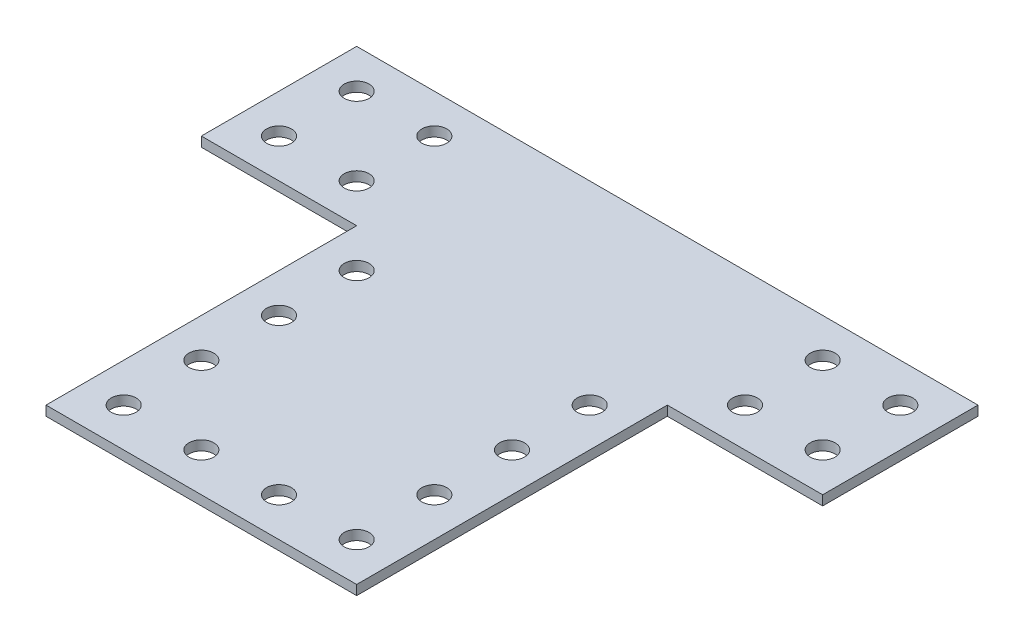
ISO-10303-21;
HEADER;
FILE_DESCRIPTION(('STEP AP214'),'2;1');
FILE_NAME('part.step','',(''),(''),'','','');
FILE_SCHEMA(('AUTOMOTIVE_DESIGN { 1 0 10303 214 1 1 1 1 }'));
ENDSEC;
DATA;
#1=APPLICATION_CONTEXT('core data for automotive mechanical design processes');
#2=APPLICATION_PROTOCOL_DEFINITION('international standard','automotive_design',2000,#1);
#3=PRODUCT_CONTEXT('',#1,'mechanical');
#4=PRODUCT('Part','Part','',(#3));
#5=PRODUCT_RELATED_PRODUCT_CATEGORY('part','',(#4));
#6=PRODUCT_DEFINITION_FORMATION('','',#4);
#7=PRODUCT_DEFINITION_CONTEXT('part definition',#1,'design');
#8=PRODUCT_DEFINITION('design','',#6,#7);
#9=PRODUCT_DEFINITION_SHAPE('','',#8);
#10=(LENGTH_UNIT() NAMED_UNIT(*) SI_UNIT(.MILLI.,.METRE.));
#11=(NAMED_UNIT(*) PLANE_ANGLE_UNIT() SI_UNIT($,.RADIAN.));
#12=(NAMED_UNIT(*) SI_UNIT($,.STERADIAN.) SOLID_ANGLE_UNIT());
#13=UNCERTAINTY_MEASURE_WITH_UNIT(LENGTH_MEASURE(1.E-05),#10,'distance_accuracy_value','');
#14=(GEOMETRIC_REPRESENTATION_CONTEXT(3) GLOBAL_UNCERTAINTY_ASSIGNED_CONTEXT((#13)) GLOBAL_UNIT_ASSIGNED_CONTEXT((#10,
#11,#12)) REPRESENTATION_CONTEXT('',''));
#15=CARTESIAN_POINT('',(0.,0.,0.));
#16=DIRECTION('',(0.,0.,1.));
#17=DIRECTION('',(1.,0.,0.));
#18=AXIS2_PLACEMENT_3D('',#15,#16,#17);
#19=CARTESIAN_POINT('',(0.,1.5875,25.4));
#20=DIRECTION('',(1.,0.,0.));
#21=DIRECTION('',(0.,0.,-1.));
#22=AXIS2_PLACEMENT_3D('',#19,#20,#21);
#23=PLANE('',#22);
#24=DIRECTION('',(0.,0.,1.));
#25=VECTOR('',#24,1.);
#26=CARTESIAN_POINT('',(0.,0.,25.4));
#27=LINE('',#26,#25);
#28=CARTESIAN_POINT('',(0.,0.,0.));
#29=VERTEX_POINT('',#28);
#30=CARTESIAN_POINT('',(0.,0.,25.4));
#31=VERTEX_POINT('',#30);
#32=EDGE_CURVE('E130',#29,#31,#27,.T.);
#33=ORIENTED_EDGE('',*,*,#32,.T.);
#34=DIRECTION('',(0.,-1.,0.));
#35=VECTOR('',#34,1.);
#36=CARTESIAN_POINT('',(0.,1.5875,25.4));
#37=LINE('',#36,#35);
#38=CARTESIAN_POINT('',(0.,1.5875,25.4));
#39=VERTEX_POINT('',#38);
#40=EDGE_CURVE('E11',#39,#31,#37,.T.);
#41=ORIENTED_EDGE('',*,*,#40,.F.);
#42=DIRECTION('',(0.,0.,1.));
#43=VECTOR('',#42,1.);
#44=CARTESIAN_POINT('',(0.,1.5875,25.4));
#45=LINE('',#44,#43);
#46=CARTESIAN_POINT('',(0.,1.5875,0.));
#47=VERTEX_POINT('',#46);
#48=EDGE_CURVE('E145',#47,#39,#45,.T.);
#49=ORIENTED_EDGE('',*,*,#48,.F.);
#50=DIRECTION('',(0.,-1.,0.));
#51=VECTOR('',#50,1.);
#52=CARTESIAN_POINT('',(0.,1.5875,0.));
#53=LINE('',#52,#51);
#54=EDGE_CURVE('E126',#47,#29,#53,.T.);
#55=ORIENTED_EDGE('',*,*,#54,.T.);
#56=EDGE_LOOP('',(#33,#41,#49,#55));
#57=FACE_BOUND('',#56,.T.);
#58=ADVANCED_FACE('F34',(#57),#23,.F.);
#59=CARTESIAN_POINT('',(25.4,1.5875,25.4));
#60=DIRECTION('',(0.,0.,-1.));
#61=DIRECTION('',(-1.,0.,0.));
#62=AXIS2_PLACEMENT_3D('',#59,#60,#61);
#63=PLANE('',#62);
#64=DIRECTION('',(1.,0.,0.));
#65=VECTOR('',#64,1.);
#66=CARTESIAN_POINT('',(25.4,0.,25.4));
#67=LINE('',#66,#65);
#68=CARTESIAN_POINT('',(25.4,0.,25.4));
#69=VERTEX_POINT('',#68);
#70=EDGE_CURVE('E133',#31,#69,#67,.T.);
#71=ORIENTED_EDGE('',*,*,#70,.T.);
#72=DIRECTION('',(0.,-1.,0.));
#73=VECTOR('',#72,1.);
#74=CARTESIAN_POINT('',(25.4,1.5875,25.4));
#75=LINE('',#74,#73);
#76=CARTESIAN_POINT('',(25.4,1.5875,25.4));
#77=VERTEX_POINT('',#76);
#78=EDGE_CURVE('E42',#77,#69,#75,.T.);
#79=ORIENTED_EDGE('',*,*,#78,.F.);
#80=DIRECTION('',(1.,0.,0.));
#81=VECTOR('',#80,1.);
#82=CARTESIAN_POINT('',(25.4,1.5875,25.4));
#83=LINE('',#82,#81);
#84=EDGE_CURVE('E93',#39,#77,#83,.T.);
#85=ORIENTED_EDGE('',*,*,#84,.F.);
#86=ORIENTED_EDGE('',*,*,#40,.T.);
#87=EDGE_LOOP('',(#71,#79,#85,#86));
#88=FACE_BOUND('',#87,.T.);
#89=ADVANCED_FACE('F332',(#88),#63,.F.);
#90=CARTESIAN_POINT('',(25.4,1.5875,76.2));
#91=DIRECTION('',(1.,0.,0.));
#92=DIRECTION('',(0.,0.,-1.));
#93=AXIS2_PLACEMENT_3D('',#90,#91,#92);
#94=PLANE('',#93);
#95=DIRECTION('',(0.,0.,1.));
#96=VECTOR('',#95,1.);
#97=CARTESIAN_POINT('',(25.4,0.,76.2));
#98=LINE('',#97,#96);
#99=CARTESIAN_POINT('',(25.4,0.,76.2));
#100=VERTEX_POINT('',#99);
#101=EDGE_CURVE('E136',#69,#100,#98,.T.);
#102=ORIENTED_EDGE('',*,*,#101,.T.);
#103=DIRECTION('',(0.,-1.,0.));
#104=VECTOR('',#103,1.);
#105=CARTESIAN_POINT('',(25.4,1.5875,76.2));
#106=LINE('',#105,#104);
#107=CARTESIAN_POINT('',(25.4,1.5875,76.2));
#108=VERTEX_POINT('',#107);
#109=EDGE_CURVE('E152',#108,#100,#106,.T.);
#110=ORIENTED_EDGE('',*,*,#109,.F.);
#111=DIRECTION('',(0.,0.,1.));
#112=VECTOR('',#111,1.);
#113=CARTESIAN_POINT('',(25.4,1.5875,76.2));
#114=LINE('',#113,#112);
#115=EDGE_CURVE('E160',#77,#108,#114,.T.);
#116=ORIENTED_EDGE('',*,*,#115,.F.);
#117=ORIENTED_EDGE('',*,*,#78,.T.);
#118=EDGE_LOOP('',(#102,#110,#116,#117));
#119=FACE_BOUND('',#118,.T.);
#120=ADVANCED_FACE('F158',(#119),#94,.F.);
#121=CARTESIAN_POINT('',(76.2,1.5875,76.2));
#122=DIRECTION('',(0.,0.,-1.));
#123=DIRECTION('',(-1.,0.,0.));
#124=AXIS2_PLACEMENT_3D('',#121,#122,#123);
#125=PLANE('',#124);
#126=DIRECTION('',(1.,0.,0.));
#127=VECTOR('',#126,1.);
#128=CARTESIAN_POINT('',(76.2,0.,76.2));
#129=LINE('',#128,#127);
#130=CARTESIAN_POINT('',(76.2,0.,76.2));
#131=VERTEX_POINT('',#130);
#132=EDGE_CURVE('E138',#100,#131,#129,.T.);
#133=ORIENTED_EDGE('',*,*,#132,.T.);
#134=DIRECTION('',(0.,-1.,0.));
#135=VECTOR('',#134,1.);
#136=CARTESIAN_POINT('',(76.2,1.5875,76.2));
#137=LINE('',#136,#135);
#138=CARTESIAN_POINT('',(76.2,1.5875,76.2));
#139=VERTEX_POINT('',#138);
#140=EDGE_CURVE('E149',#139,#131,#137,.T.);
#141=ORIENTED_EDGE('',*,*,#140,.F.);
#142=DIRECTION('',(1.,0.,0.));
#143=VECTOR('',#142,1.);
#144=CARTESIAN_POINT('',(76.2,1.5875,76.2));
#145=LINE('',#144,#143);
#146=EDGE_CURVE('E172',#108,#139,#145,.T.);
#147=ORIENTED_EDGE('',*,*,#146,.F.);
#148=ORIENTED_EDGE('',*,*,#109,.T.);
#149=EDGE_LOOP('',(#133,#141,#147,#148));
#150=FACE_BOUND('',#149,.T.);
#151=ADVANCED_FACE('F168',(#150),#125,.F.);
#152=CARTESIAN_POINT('',(76.2,1.5875,25.4));
#153=DIRECTION('',(-1.,0.,0.));
#154=DIRECTION('',(0.,0.,1.));
#155=AXIS2_PLACEMENT_3D('',#152,#153,#154);
#156=PLANE('',#155);
#157=DIRECTION('',(0.,0.,-1.));
#158=VECTOR('',#157,1.);
#159=CARTESIAN_POINT('',(76.2,0.,25.4));
#160=LINE('',#159,#158);
#161=CARTESIAN_POINT('',(76.2,0.,25.4));
#162=VERTEX_POINT('',#161);
#163=EDGE_CURVE('E140',#131,#162,#160,.T.);
#164=ORIENTED_EDGE('',*,*,#163,.T.);
#165=DIRECTION('',(0.,-1.,0.));
#166=VECTOR('',#165,1.);
#167=CARTESIAN_POINT('',(76.2,1.5875,25.4));
#168=LINE('',#167,#166);
#169=CARTESIAN_POINT('',(76.2,1.5875,25.4));
#170=VERTEX_POINT('',#169);
#171=EDGE_CURVE('E121',#170,#162,#168,.T.);
#172=ORIENTED_EDGE('',*,*,#171,.F.);
#173=DIRECTION('',(0.,0.,-1.));
#174=VECTOR('',#173,1.);
#175=CARTESIAN_POINT('',(76.2,1.5875,25.4));
#176=LINE('',#175,#174);
#177=EDGE_CURVE('E112',#139,#170,#176,.T.);
#178=ORIENTED_EDGE('',*,*,#177,.F.);
#179=ORIENTED_EDGE('',*,*,#140,.T.);
#180=EDGE_LOOP('',(#164,#172,#178,#179));
#181=FACE_BOUND('',#180,.T.);
#182=ADVANCED_FACE('F171',(#181),#156,.F.);
#183=CARTESIAN_POINT('',(101.6,1.5875,25.4));
#184=DIRECTION('',(0.,0.,-1.));
#185=DIRECTION('',(-1.,0.,0.));
#186=AXIS2_PLACEMENT_3D('',#183,#184,#185);
#187=PLANE('',#186);
#188=DIRECTION('',(1.,0.,0.));
#189=VECTOR('',#188,1.);
#190=CARTESIAN_POINT('',(101.6,0.,25.4));
#191=LINE('',#190,#189);
#192=CARTESIAN_POINT('',(101.6,0.,25.4));
#193=VERTEX_POINT('',#192);
#194=EDGE_CURVE('E120',#162,#193,#191,.T.);
#195=ORIENTED_EDGE('',*,*,#194,.T.);
#196=DIRECTION('',(0.,-1.,0.));
#197=VECTOR('',#196,1.);
#198=CARTESIAN_POINT('',(101.6,1.5875,25.4));
#199=LINE('',#198,#197);
#200=CARTESIAN_POINT('',(101.6,1.5875,25.4));
#201=VERTEX_POINT('',#200);
#202=EDGE_CURVE('E117',#201,#193,#199,.T.);
#203=ORIENTED_EDGE('',*,*,#202,.F.);
#204=DIRECTION('',(1.,0.,0.));
#205=VECTOR('',#204,1.);
#206=CARTESIAN_POINT('',(101.6,1.5875,25.4));
#207=LINE('',#206,#205);
#208=EDGE_CURVE('E106',#170,#201,#207,.T.);
#209=ORIENTED_EDGE('',*,*,#208,.F.);
#210=ORIENTED_EDGE('',*,*,#171,.T.);
#211=EDGE_LOOP('',(#195,#203,#209,#210));
#212=FACE_BOUND('',#211,.T.);
#213=ADVANCED_FACE('F118',(#212),#187,.F.);
#214=CARTESIAN_POINT('',(101.6,1.5875,0.));
#215=DIRECTION('',(-1.,0.,0.));
#216=DIRECTION('',(0.,0.,1.));
#217=AXIS2_PLACEMENT_3D('',#214,#215,#216);
#218=PLANE('',#217);
#219=DIRECTION('',(0.,0.,-1.));
#220=VECTOR('',#219,1.);
#221=CARTESIAN_POINT('',(101.6,0.,0.));
#222=LINE('',#221,#220);
#223=CARTESIAN_POINT('',(101.6,0.,0.));
#224=VERTEX_POINT('',#223);
#225=EDGE_CURVE('E79',#193,#224,#222,.T.);
#226=ORIENTED_EDGE('',*,*,#225,.T.);
#227=DIRECTION('',(0.,-1.,0.));
#228=VECTOR('',#227,1.);
#229=CARTESIAN_POINT('',(101.6,1.5875,0.));
#230=LINE('',#229,#228);
#231=CARTESIAN_POINT('',(101.6,1.5875,0.));
#232=VERTEX_POINT('',#231);
#233=EDGE_CURVE('E122',#232,#224,#230,.T.);
#234=ORIENTED_EDGE('',*,*,#233,.F.);
#235=DIRECTION('',(0.,0.,-1.));
#236=VECTOR('',#235,1.);
#237=CARTESIAN_POINT('',(101.6,1.5875,0.));
#238=LINE('',#237,#236);
#239=EDGE_CURVE('E110',#201,#232,#238,.T.);
#240=ORIENTED_EDGE('',*,*,#239,.F.);
#241=ORIENTED_EDGE('',*,*,#202,.T.);
#242=EDGE_LOOP('',(#226,#234,#240,#241));
#243=FACE_BOUND('',#242,.T.);
#244=ADVANCED_FACE('F124',(#243),#218,.F.);
#245=CARTESIAN_POINT('',(0.,1.5875,0.));
#246=DIRECTION('',(0.,0.,1.));
#247=DIRECTION('',(1.,0.,0.));
#248=AXIS2_PLACEMENT_3D('',#245,#246,#247);
#249=PLANE('',#248);
#250=DIRECTION('',(-1.,0.,0.));
#251=VECTOR('',#250,1.);
#252=CARTESIAN_POINT('',(0.,0.,0.));
#253=LINE('',#252,#251);
#254=EDGE_CURVE('E85',#224,#29,#253,.T.);
#255=ORIENTED_EDGE('',*,*,#254,.T.);
#256=ORIENTED_EDGE('',*,*,#54,.F.);
#257=DIRECTION('',(-1.,0.,0.));
#258=VECTOR('',#257,1.);
#259=CARTESIAN_POINT('',(0.,1.5875,0.));
#260=LINE('',#259,#258);
#261=EDGE_CURVE('E50',#232,#47,#260,.T.);
#262=ORIENTED_EDGE('',*,*,#261,.F.);
#263=ORIENTED_EDGE('',*,*,#233,.T.);
#264=EDGE_LOOP('',(#255,#256,#262,#263));
#265=FACE_BOUND('',#264,.T.);
#266=ADVANCED_FACE('F298',(#265),#249,.F.);
#267=CARTESIAN_POINT('',(0.,1.5875,0.));
#268=DIRECTION('',(0.,-1.,0.));
#269=DIRECTION('',(0.,0.,-1.));
#270=AXIS2_PLACEMENT_3D('',#267,#268,#269);
#271=PLANE('',#270);
#272=CARTESIAN_POINT('',(69.85,1.5875,31.75));
#273=DIRECTION('',(0.,1.,0.));
#274=DIRECTION('',(0.,0.,1.));
#275=AXIS2_PLACEMENT_3D('',#272,#273,#274);
#276=CIRCLE('',#275,2.03200000000001);
#277=CARTESIAN_POINT('',(69.85,1.5875,33.782));
#278=VERTEX_POINT('',#277);
#279=EDGE_CURVE('E226',#278,#278,#276,.T.);
#280=ORIENTED_EDGE('',*,*,#279,.F.);
#281=EDGE_LOOP('',(#280));
#282=FACE_BOUND('',#281,.T.);
#283=CARTESIAN_POINT('',(31.75,1.5875,44.45));
#284=DIRECTION('',(0.,1.,0.));
#285=DIRECTION('',(0.,0.,1.));
#286=AXIS2_PLACEMENT_3D('',#283,#284,#285);
#287=CIRCLE('',#286,2.032);
#288=CARTESIAN_POINT('',(31.75,1.5875,46.482));
#289=VERTEX_POINT('',#288);
#290=EDGE_CURVE('E239',#289,#289,#287,.T.);
#291=ORIENTED_EDGE('',*,*,#290,.F.);
#292=EDGE_LOOP('',(#291));
#293=FACE_BOUND('',#292,.T.);
#294=CARTESIAN_POINT('',(69.85,1.5875,44.45));
#295=DIRECTION('',(0.,1.,0.));
#296=DIRECTION('',(0.,0.,1.));
#297=AXIS2_PLACEMENT_3D('',#294,#295,#296);
#298=CIRCLE('',#297,2.03200000000001);
#299=CARTESIAN_POINT('',(69.85,1.5875,46.482));
#300=VERTEX_POINT('',#299);
#301=EDGE_CURVE('E232',#300,#300,#298,.T.);
#302=ORIENTED_EDGE('',*,*,#301,.F.);
#303=EDGE_LOOP('',(#302));
#304=FACE_BOUND('',#303,.T.);
#305=CARTESIAN_POINT('',(19.05,1.5875,19.05));
#306=DIRECTION('',(0.,1.,0.));
#307=DIRECTION('',(0.,0.,1.));
#308=AXIS2_PLACEMENT_3D('',#305,#306,#307);
#309=CIRCLE('',#308,2.032);
#310=CARTESIAN_POINT('',(19.05,1.5875,21.082));
#311=VERTEX_POINT('',#310);
#312=EDGE_CURVE('E202',#311,#311,#309,.T.);
#313=ORIENTED_EDGE('',*,*,#312,.F.);
#314=EDGE_LOOP('',(#313));
#315=FACE_BOUND('',#314,.T.);
#316=CARTESIAN_POINT('',(95.25,1.5875,6.35));
#317=DIRECTION('',(0.,1.,0.));
#318=DIRECTION('',(0.,0.,1.));
#319=AXIS2_PLACEMENT_3D('',#316,#317,#318);
#320=CIRCLE('',#319,2.03200000000001);
#321=CARTESIAN_POINT('',(95.25,1.5875,8.38200000000001));
#322=VERTEX_POINT('',#321);
#323=EDGE_CURVE('E184',#322,#322,#320,.T.);
#324=ORIENTED_EDGE('',*,*,#323,.F.);
#325=EDGE_LOOP('',(#324));
#326=FACE_BOUND('',#325,.T.);
#327=CARTESIAN_POINT('',(82.55,1.5875,6.35));
#328=DIRECTION('',(0.,1.,0.));
#329=DIRECTION('',(0.,0.,1.));
#330=AXIS2_PLACEMENT_3D('',#327,#328,#329);
#331=CIRCLE('',#330,2.03200000000001);
#332=CARTESIAN_POINT('',(82.55,1.5875,8.38200000000001));
#333=VERTEX_POINT('',#332);
#334=EDGE_CURVE('E191',#333,#333,#331,.T.);
#335=ORIENTED_EDGE('',*,*,#334,.F.);
#336=EDGE_LOOP('',(#335));
#337=FACE_BOUND('',#336,.T.);
#338=CARTESIAN_POINT('',(19.05,1.5875,6.35));
#339=DIRECTION('',(0.,1.,0.));
#340=DIRECTION('',(0.,0.,1.));
#341=AXIS2_PLACEMENT_3D('',#338,#339,#340);
#342=CIRCLE('',#341,2.032);
#343=CARTESIAN_POINT('',(19.05,1.5875,8.382));
#344=VERTEX_POINT('',#343);
#345=EDGE_CURVE('E197',#344,#344,#342,.T.);
#346=ORIENTED_EDGE('',*,*,#345,.F.);
#347=EDGE_LOOP('',(#346));
#348=FACE_BOUND('',#347,.T.);
#349=CARTESIAN_POINT('',(31.75,1.5875,31.75));
#350=DIRECTION('',(0.,1.,0.));
#351=DIRECTION('',(0.,0.,1.));
#352=AXIS2_PLACEMENT_3D('',#349,#350,#351);
#353=CIRCLE('',#352,2.032);
#354=CARTESIAN_POINT('',(31.75,1.5875,33.782));
#355=VERTEX_POINT('',#354);
#356=EDGE_CURVE('E220',#355,#355,#353,.T.);
#357=ORIENTED_EDGE('',*,*,#356,.F.);
#358=EDGE_LOOP('',(#357));
#359=FACE_BOUND('',#358,.T.);
#360=CARTESIAN_POINT('',(95.25,1.5875,19.05));
#361=DIRECTION('',(0.,1.,0.));
#362=DIRECTION('',(0.,0.,1.));
#363=AXIS2_PLACEMENT_3D('',#360,#361,#362);
#364=CIRCLE('',#363,2.03200000000001);
#365=CARTESIAN_POINT('',(95.25,1.5875,21.082));
#366=VERTEX_POINT('',#365);
#367=EDGE_CURVE('E208',#366,#366,#364,.T.);
#368=ORIENTED_EDGE('',*,*,#367,.F.);
#369=EDGE_LOOP('',(#368));
#370=FACE_BOUND('',#369,.T.);
#371=CARTESIAN_POINT('',(82.55,1.5875,19.05));
#372=DIRECTION('',(0.,1.,0.));
#373=DIRECTION('',(0.,0.,1.));
#374=AXIS2_PLACEMENT_3D('',#371,#372,#373);
#375=CIRCLE('',#374,2.03200000000001);
#376=CARTESIAN_POINT('',(82.55,1.5875,21.082));
#377=VERTEX_POINT('',#376);
#378=EDGE_CURVE('E215',#377,#377,#375,.T.);
#379=ORIENTED_EDGE('',*,*,#378,.F.);
#380=EDGE_LOOP('',(#379));
#381=FACE_BOUND('',#380,.T.);
#382=CARTESIAN_POINT('',(6.35,1.5875,19.05));
#383=DIRECTION('',(0.,1.,0.));
#384=DIRECTION('',(0.,0.,1.));
#385=AXIS2_PLACEMENT_3D('',#382,#383,#384);
#386=CIRCLE('',#385,2.032);
#387=CARTESIAN_POINT('',(6.35,1.5875,21.082));
#388=VERTEX_POINT('',#387);
#389=EDGE_CURVE('E280',#388,#388,#386,.T.);
#390=ORIENTED_EDGE('',*,*,#389,.F.);
#391=EDGE_LOOP('',(#390));
#392=FACE_BOUND('',#391,.T.);
#393=CARTESIAN_POINT('',(31.75,1.5875,57.15));
#394=DIRECTION('',(0.,1.,0.));
#395=DIRECTION('',(0.,0.,1.));
#396=AXIS2_PLACEMENT_3D('',#393,#394,#395);
#397=CIRCLE('',#396,2.032);
#398=CARTESIAN_POINT('',(31.75,1.5875,59.182));
#399=VERTEX_POINT('',#398);
#400=EDGE_CURVE('E251',#399,#399,#397,.T.);
#401=ORIENTED_EDGE('',*,*,#400,.F.);
#402=EDGE_LOOP('',(#401));
#403=FACE_BOUND('',#402,.T.);
#404=CARTESIAN_POINT('',(69.85,1.5875,57.15));
#405=DIRECTION('',(0.,1.,0.));
#406=DIRECTION('',(0.,0.,1.));
#407=AXIS2_PLACEMENT_3D('',#404,#405,#406);
#408=CIRCLE('',#407,2.03200000000001);
#409=CARTESIAN_POINT('',(69.85,1.5875,59.182));
#410=VERTEX_POINT('',#409);
#411=EDGE_CURVE('E244',#410,#410,#408,.T.);
#412=ORIENTED_EDGE('',*,*,#411,.F.);
#413=EDGE_LOOP('',(#412));
#414=FACE_BOUND('',#413,.T.);
#415=CARTESIAN_POINT('',(69.85,1.5875,69.85));
#416=DIRECTION('',(0.,1.,0.));
#417=DIRECTION('',(0.,0.,1.));
#418=AXIS2_PLACEMENT_3D('',#415,#416,#417);
#419=CIRCLE('',#418,2.032);
#420=CARTESIAN_POINT('',(69.85,1.5875,71.882));
#421=VERTEX_POINT('',#420);
#422=EDGE_CURVE('E268',#421,#421,#419,.T.);
#423=ORIENTED_EDGE('',*,*,#422,.F.);
#424=EDGE_LOOP('',(#423));
#425=FACE_BOUND('',#424,.T.);
#426=CARTESIAN_POINT('',(57.15,1.5875,69.85));
#427=DIRECTION('',(0.,1.,0.));
#428=DIRECTION('',(0.,0.,1.));
#429=AXIS2_PLACEMENT_3D('',#426,#427,#428);
#430=CIRCLE('',#429,2.03199999999999);
#431=CARTESIAN_POINT('',(57.15,1.5875,71.882));
#432=VERTEX_POINT('',#431);
#433=EDGE_CURVE('E275',#432,#432,#430,.T.);
#434=ORIENTED_EDGE('',*,*,#433,.F.);
#435=EDGE_LOOP('',(#434));
#436=FACE_BOUND('',#435,.T.);
#437=CARTESIAN_POINT('',(31.75,1.5875,69.85));
#438=DIRECTION('',(0.,1.,0.));
#439=DIRECTION('',(0.,0.,1.));
#440=AXIS2_PLACEMENT_3D('',#437,#438,#439);
#441=CIRCLE('',#440,2.032);
#442=CARTESIAN_POINT('',(31.75,1.5875,71.882));
#443=VERTEX_POINT('',#442);
#444=EDGE_CURVE('E263',#443,#443,#441,.T.);
#445=ORIENTED_EDGE('',*,*,#444,.F.);
#446=EDGE_LOOP('',(#445));
#447=FACE_BOUND('',#446,.T.);
#448=CARTESIAN_POINT('',(44.45,1.5875,69.85));
#449=DIRECTION('',(0.,1.,0.));
#450=DIRECTION('',(0.,0.,1.));
#451=AXIS2_PLACEMENT_3D('',#448,#449,#450);
#452=CIRCLE('',#451,2.032);
#453=CARTESIAN_POINT('',(44.45,1.5875,71.882));
#454=VERTEX_POINT('',#453);
#455=EDGE_CURVE('E256',#454,#454,#452,.T.);
#456=ORIENTED_EDGE('',*,*,#455,.F.);
#457=EDGE_LOOP('',(#456));
#458=FACE_BOUND('',#457,.T.);
#459=CARTESIAN_POINT('',(6.35,1.5875,6.35));
#460=DIRECTION('',(0.,1.,0.));
#461=DIRECTION('',(0.,0.,1.));
#462=AXIS2_PLACEMENT_3D('',#459,#460,#461);
#463=CIRCLE('',#462,2.032);
#464=CARTESIAN_POINT('',(6.35,1.5875,8.382));
#465=VERTEX_POINT('',#464);
#466=EDGE_CURVE('E178',#465,#465,#463,.T.);
#467=ORIENTED_EDGE('',*,*,#466,.F.);
#468=EDGE_LOOP('',(#467));
#469=FACE_BOUND('',#468,.T.);
#470=ORIENTED_EDGE('',*,*,#48,.T.);
#471=ORIENTED_EDGE('',*,*,#84,.T.);
#472=ORIENTED_EDGE('',*,*,#115,.T.);
#473=ORIENTED_EDGE('',*,*,#146,.T.);
#474=ORIENTED_EDGE('',*,*,#177,.T.);
#475=ORIENTED_EDGE('',*,*,#208,.T.);
#476=ORIENTED_EDGE('',*,*,#239,.T.);
#477=ORIENTED_EDGE('',*,*,#261,.T.);
#478=EDGE_LOOP('',(#470,#471,#472,#473,#474,#475,#476,#477));
#479=FACE_BOUND('',#478,.T.);
#480=ADVANCED_FACE('F108',(#282,#293,#304,#315,#326,#337,#348,#359,#370,#381,#392,#403,#414,
#425,#436,#447,#458,#469,#479),#271,.F.);
#481=CARTESIAN_POINT('',(0.,0.,0.));
#482=DIRECTION('',(0.,-1.,0.));
#483=DIRECTION('',(0.,0.,-1.));
#484=AXIS2_PLACEMENT_3D('',#481,#482,#483);
#485=PLANE('',#484);
#486=CARTESIAN_POINT('',(69.85,0.,31.75));
#487=DIRECTION('',(0.,1.,0.));
#488=DIRECTION('',(0.,0.,1.));
#489=AXIS2_PLACEMENT_3D('',#486,#487,#488);
#490=CIRCLE('',#489,2.03200000000001);
#491=CARTESIAN_POINT('',(69.85,0.,33.782));
#492=VERTEX_POINT('',#491);
#493=EDGE_CURVE('E223',#492,#492,#490,.T.);
#494=ORIENTED_EDGE('',*,*,#493,.T.);
#495=EDGE_LOOP('',(#494));
#496=FACE_BOUND('',#495,.T.);
#497=CARTESIAN_POINT('',(31.75,0.,44.45));
#498=DIRECTION('',(0.,1.,0.));
#499=DIRECTION('',(0.,0.,1.));
#500=AXIS2_PLACEMENT_3D('',#497,#498,#499);
#501=CIRCLE('',#500,2.032);
#502=CARTESIAN_POINT('',(31.75,0.,46.482));
#503=VERTEX_POINT('',#502);
#504=EDGE_CURVE('E229',#503,#503,#501,.T.);
#505=ORIENTED_EDGE('',*,*,#504,.T.);
#506=EDGE_LOOP('',(#505));
#507=FACE_BOUND('',#506,.T.);
#508=CARTESIAN_POINT('',(69.85,0.,44.45));
#509=DIRECTION('',(0.,1.,0.));
#510=DIRECTION('',(0.,0.,1.));
#511=AXIS2_PLACEMENT_3D('',#508,#509,#510);
#512=CIRCLE('',#511,2.03200000000001);
#513=CARTESIAN_POINT('',(69.85,0.,46.482));
#514=VERTEX_POINT('',#513);
#515=EDGE_CURVE('E235',#514,#514,#512,.T.);
#516=ORIENTED_EDGE('',*,*,#515,.T.);
#517=EDGE_LOOP('',(#516));
#518=FACE_BOUND('',#517,.T.);
#519=CARTESIAN_POINT('',(19.05,0.,19.05));
#520=DIRECTION('',(0.,1.,0.));
#521=DIRECTION('',(0.,0.,1.));
#522=AXIS2_PLACEMENT_3D('',#519,#520,#521);
#523=CIRCLE('',#522,2.032);
#524=CARTESIAN_POINT('',(19.05,0.,21.082));
#525=VERTEX_POINT('',#524);
#526=EDGE_CURVE('E188',#525,#525,#523,.T.);
#527=ORIENTED_EDGE('',*,*,#526,.T.);
#528=EDGE_LOOP('',(#527));
#529=FACE_BOUND('',#528,.T.);
#530=CARTESIAN_POINT('',(95.25,0.,6.35));
#531=DIRECTION('',(0.,1.,0.));
#532=DIRECTION('',(0.,0.,1.));
#533=AXIS2_PLACEMENT_3D('',#530,#531,#532);
#534=CIRCLE('',#533,2.03200000000001);
#535=CARTESIAN_POINT('',(95.25,0.,8.38200000000001));
#536=VERTEX_POINT('',#535);
#537=EDGE_CURVE('E187',#536,#536,#534,.T.);
#538=ORIENTED_EDGE('',*,*,#537,.T.);
#539=EDGE_LOOP('',(#538));
#540=FACE_BOUND('',#539,.T.);
#541=CARTESIAN_POINT('',(82.55,0.,6.35));
#542=DIRECTION('',(0.,1.,0.));
#543=DIRECTION('',(0.,0.,1.));
#544=AXIS2_PLACEMENT_3D('',#541,#542,#543);
#545=CIRCLE('',#544,2.03200000000001);
#546=CARTESIAN_POINT('',(82.55,0.,8.38200000000001));
#547=VERTEX_POINT('',#546);
#548=EDGE_CURVE('E194',#547,#547,#545,.T.);
#549=ORIENTED_EDGE('',*,*,#548,.T.);
#550=EDGE_LOOP('',(#549));
#551=FACE_BOUND('',#550,.T.);
#552=CARTESIAN_POINT('',(19.05,0.,6.35));
#553=DIRECTION('',(0.,1.,0.));
#554=DIRECTION('',(0.,0.,1.));
#555=AXIS2_PLACEMENT_3D('',#552,#553,#554);
#556=CIRCLE('',#555,2.032);
#557=CARTESIAN_POINT('',(19.05,0.,8.382));
#558=VERTEX_POINT('',#557);
#559=EDGE_CURVE('E181',#558,#558,#556,.T.);
#560=ORIENTED_EDGE('',*,*,#559,.T.);
#561=EDGE_LOOP('',(#560));
#562=FACE_BOUND('',#561,.T.);
#563=CARTESIAN_POINT('',(31.75,0.,31.75));
#564=DIRECTION('',(0.,1.,0.));
#565=DIRECTION('',(0.,0.,1.));
#566=AXIS2_PLACEMENT_3D('',#563,#564,#565);
#567=CIRCLE('',#566,2.032);
#568=CARTESIAN_POINT('',(31.75,0.,33.782));
#569=VERTEX_POINT('',#568);
#570=EDGE_CURVE('E212',#569,#569,#567,.T.);
#571=ORIENTED_EDGE('',*,*,#570,.T.);
#572=EDGE_LOOP('',(#571));
#573=FACE_BOUND('',#572,.T.);
#574=CARTESIAN_POINT('',(95.25,0.,19.05));
#575=DIRECTION('',(0.,1.,0.));
#576=DIRECTION('',(0.,0.,1.));
#577=AXIS2_PLACEMENT_3D('',#574,#575,#576);
#578=CIRCLE('',#577,2.03200000000001);
#579=CARTESIAN_POINT('',(95.25,0.,21.082));
#580=VERTEX_POINT('',#579);
#581=EDGE_CURVE('E211',#580,#580,#578,.T.);
#582=ORIENTED_EDGE('',*,*,#581,.T.);
#583=EDGE_LOOP('',(#582));
#584=FACE_BOUND('',#583,.T.);
#585=CARTESIAN_POINT('',(82.55,0.,19.05));
#586=DIRECTION('',(0.,1.,0.));
#587=DIRECTION('',(0.,0.,1.));
#588=AXIS2_PLACEMENT_3D('',#585,#586,#587);
#589=CIRCLE('',#588,2.03200000000001);
#590=CARTESIAN_POINT('',(82.55,0.,21.082));
#591=VERTEX_POINT('',#590);
#592=EDGE_CURVE('E205',#591,#591,#589,.T.);
#593=ORIENTED_EDGE('',*,*,#592,.T.);
#594=EDGE_LOOP('',(#593));
#595=FACE_BOUND('',#594,.T.);
#596=CARTESIAN_POINT('',(6.35,0.,19.05));
#597=DIRECTION('',(0.,1.,0.));
#598=DIRECTION('',(0.,0.,1.));
#599=AXIS2_PLACEMENT_3D('',#596,#597,#598);
#600=CIRCLE('',#599,2.032);
#601=CARTESIAN_POINT('',(6.35,0.,21.082));
#602=VERTEX_POINT('',#601);
#603=EDGE_CURVE('E272',#602,#602,#600,.T.);
#604=ORIENTED_EDGE('',*,*,#603,.T.);
#605=EDGE_LOOP('',(#604));
#606=FACE_BOUND('',#605,.T.);
#607=CARTESIAN_POINT('',(31.75,0.,57.15));
#608=DIRECTION('',(0.,1.,0.));
#609=DIRECTION('',(0.,0.,1.));
#610=AXIS2_PLACEMENT_3D('',#607,#608,#609);
#611=CIRCLE('',#610,2.032);
#612=CARTESIAN_POINT('',(31.75,0.,59.182));
#613=VERTEX_POINT('',#612);
#614=EDGE_CURVE('E236',#613,#613,#611,.T.);
#615=ORIENTED_EDGE('',*,*,#614,.T.);
#616=EDGE_LOOP('',(#615));
#617=FACE_BOUND('',#616,.T.);
#618=CARTESIAN_POINT('',(69.85,0.,57.15));
#619=DIRECTION('',(0.,1.,0.));
#620=DIRECTION('',(0.,0.,1.));
#621=AXIS2_PLACEMENT_3D('',#618,#619,#620);
#622=CIRCLE('',#621,2.03200000000001);
#623=CARTESIAN_POINT('',(69.85,0.,59.182));
#624=VERTEX_POINT('',#623);
#625=EDGE_CURVE('E247',#624,#624,#622,.T.);
#626=ORIENTED_EDGE('',*,*,#625,.T.);
#627=EDGE_LOOP('',(#626));
#628=FACE_BOUND('',#627,.T.);
#629=CARTESIAN_POINT('',(69.85,0.,69.85));
#630=DIRECTION('',(0.,1.,0.));
#631=DIRECTION('',(0.,0.,1.));
#632=AXIS2_PLACEMENT_3D('',#629,#630,#631);
#633=CIRCLE('',#632,2.032);
#634=CARTESIAN_POINT('',(69.85,0.,71.882));
#635=VERTEX_POINT('',#634);
#636=EDGE_CURVE('E271',#635,#635,#633,.T.);
#637=ORIENTED_EDGE('',*,*,#636,.T.);
#638=EDGE_LOOP('',(#637));
#639=FACE_BOUND('',#638,.T.);
#640=CARTESIAN_POINT('',(57.15,0.,69.85));
#641=DIRECTION('',(0.,1.,0.));
#642=DIRECTION('',(0.,0.,1.));
#643=AXIS2_PLACEMENT_3D('',#640,#641,#642);
#644=CIRCLE('',#643,2.03199999999999);
#645=CARTESIAN_POINT('',(57.15,0.,71.882));
#646=VERTEX_POINT('',#645);
#647=EDGE_CURVE('E260',#646,#646,#644,.T.);
#648=ORIENTED_EDGE('',*,*,#647,.T.);
#649=EDGE_LOOP('',(#648));
#650=FACE_BOUND('',#649,.T.);
#651=CARTESIAN_POINT('',(31.75,0.,69.85));
#652=DIRECTION('',(0.,1.,0.));
#653=DIRECTION('',(0.,0.,1.));
#654=AXIS2_PLACEMENT_3D('',#651,#652,#653);
#655=CIRCLE('',#654,2.032);
#656=CARTESIAN_POINT('',(31.75,0.,71.882));
#657=VERTEX_POINT('',#656);
#658=EDGE_CURVE('E248',#657,#657,#655,.T.);
#659=ORIENTED_EDGE('',*,*,#658,.T.);
#660=EDGE_LOOP('',(#659));
#661=FACE_BOUND('',#660,.T.);
#662=CARTESIAN_POINT('',(44.45,0.,69.85));
#663=DIRECTION('',(0.,1.,0.));
#664=DIRECTION('',(0.,0.,1.));
#665=AXIS2_PLACEMENT_3D('',#662,#663,#664);
#666=CIRCLE('',#665,2.032);
#667=CARTESIAN_POINT('',(44.45,0.,71.882));
#668=VERTEX_POINT('',#667);
#669=EDGE_CURVE('E259',#668,#668,#666,.T.);
#670=ORIENTED_EDGE('',*,*,#669,.T.);
#671=EDGE_LOOP('',(#670));
#672=FACE_BOUND('',#671,.T.);
#673=CARTESIAN_POINT('',(6.35,0.,6.35));
#674=DIRECTION('',(0.,1.,0.));
#675=DIRECTION('',(0.,0.,1.));
#676=AXIS2_PLACEMENT_3D('',#673,#674,#675);
#677=CIRCLE('',#676,2.032);
#678=CARTESIAN_POINT('',(6.35,0.,8.382));
#679=VERTEX_POINT('',#678);
#680=EDGE_CURVE('E134',#679,#679,#677,.T.);
#681=ORIENTED_EDGE('',*,*,#680,.T.);
#682=EDGE_LOOP('',(#681));
#683=FACE_BOUND('',#682,.T.);
#684=ORIENTED_EDGE('',*,*,#32,.F.);
#685=ORIENTED_EDGE('',*,*,#254,.F.);
#686=ORIENTED_EDGE('',*,*,#225,.F.);
#687=ORIENTED_EDGE('',*,*,#194,.F.);
#688=ORIENTED_EDGE('',*,*,#163,.F.);
#689=ORIENTED_EDGE('',*,*,#132,.F.);
#690=ORIENTED_EDGE('',*,*,#101,.F.);
#691=ORIENTED_EDGE('',*,*,#70,.F.);
#692=EDGE_LOOP('',(#684,#685,#686,#687,#688,#689,#690,#691));
#693=FACE_BOUND('',#692,.T.);
#694=ADVANCED_FACE('F164',(#496,#507,#518,#529,#540,#551,#562,#573,#584,#595,#606,#617,#628,
#639,#650,#661,#672,#683,#693),#485,.T.);
#695=CARTESIAN_POINT('',(6.35,0.,6.35));
#696=DIRECTION('',(0.,1.,0.));
#697=DIRECTION('',(0.,0.,1.));
#698=AXIS2_PLACEMENT_3D('',#695,#696,#697);
#699=CYLINDRICAL_SURFACE('',#698,2.032);
#700=ORIENTED_EDGE('',*,*,#680,.F.);
#701=EDGE_LOOP('',(#700));
#702=FACE_BOUND('',#701,.T.);
#703=ORIENTED_EDGE('',*,*,#466,.T.);
#704=EDGE_LOOP('',(#703));
#705=FACE_BOUND('',#704,.T.);
#706=ADVANCED_FACE('F315',(#702,#705),#699,.F.);
#707=CARTESIAN_POINT('',(44.45,0.,69.85));
#708=DIRECTION('',(0.,1.,0.));
#709=DIRECTION('',(0.,0.,1.));
#710=AXIS2_PLACEMENT_3D('',#707,#708,#709);
#711=CYLINDRICAL_SURFACE('',#710,2.032);
#712=ORIENTED_EDGE('',*,*,#669,.F.);
#713=EDGE_LOOP('',(#712));
#714=FACE_BOUND('',#713,.T.);
#715=ORIENTED_EDGE('',*,*,#455,.T.);
#716=EDGE_LOOP('',(#715));
#717=FACE_BOUND('',#716,.T.);
#718=ADVANCED_FACE('F317',(#714,#717),#711,.F.);
#719=CARTESIAN_POINT('',(31.75,0.,69.85));
#720=DIRECTION('',(0.,1.,0.));
#721=DIRECTION('',(0.,0.,1.));
#722=AXIS2_PLACEMENT_3D('',#719,#720,#721);
#723=CYLINDRICAL_SURFACE('',#722,2.032);
#724=ORIENTED_EDGE('',*,*,#658,.F.);
#725=EDGE_LOOP('',(#724));
#726=FACE_BOUND('',#725,.T.);
#727=ORIENTED_EDGE('',*,*,#444,.T.);
#728=EDGE_LOOP('',(#727));
#729=FACE_BOUND('',#728,.T.);
#730=ADVANCED_FACE('F324',(#726,#729),#723,.F.);
#731=CARTESIAN_POINT('',(57.15,0.,69.85));
#732=DIRECTION('',(0.,1.,0.));
#733=DIRECTION('',(0.,0.,1.));
#734=AXIS2_PLACEMENT_3D('',#731,#732,#733);
#735=CYLINDRICAL_SURFACE('',#734,2.03199999999999);
#736=ORIENTED_EDGE('',*,*,#647,.F.);
#737=EDGE_LOOP('',(#736));
#738=FACE_BOUND('',#737,.T.);
#739=ORIENTED_EDGE('',*,*,#433,.T.);
#740=EDGE_LOOP('',(#739));
#741=FACE_BOUND('',#740,.T.);
#742=ADVANCED_FACE('F408',(#738,#741),#735,.F.);
#743=CARTESIAN_POINT('',(69.85,0.,69.85));
#744=DIRECTION('',(0.,1.,0.));
#745=DIRECTION('',(0.,0.,1.));
#746=AXIS2_PLACEMENT_3D('',#743,#744,#745);
#747=CYLINDRICAL_SURFACE('',#746,2.032);
#748=ORIENTED_EDGE('',*,*,#636,.F.);
#749=EDGE_LOOP('',(#748));
#750=FACE_BOUND('',#749,.T.);
#751=ORIENTED_EDGE('',*,*,#422,.T.);
#752=EDGE_LOOP('',(#751));
#753=FACE_BOUND('',#752,.T.);
#754=ADVANCED_FACE('F418',(#750,#753),#747,.F.);
#755=CARTESIAN_POINT('',(69.85,0.,57.15));
#756=DIRECTION('',(0.,1.,0.));
#757=DIRECTION('',(0.,0.,1.));
#758=AXIS2_PLACEMENT_3D('',#755,#756,#757);
#759=CYLINDRICAL_SURFACE('',#758,2.03200000000001);
#760=ORIENTED_EDGE('',*,*,#625,.F.);
#761=EDGE_LOOP('',(#760));
#762=FACE_BOUND('',#761,.T.);
#763=ORIENTED_EDGE('',*,*,#411,.T.);
#764=EDGE_LOOP('',(#763));
#765=FACE_BOUND('',#764,.T.);
#766=ADVANCED_FACE('F428',(#762,#765),#759,.F.);
#767=CARTESIAN_POINT('',(31.75,0.,57.15));
#768=DIRECTION('',(0.,1.,0.));
#769=DIRECTION('',(0.,0.,1.));
#770=AXIS2_PLACEMENT_3D('',#767,#768,#769);
#771=CYLINDRICAL_SURFACE('',#770,2.032);
#772=ORIENTED_EDGE('',*,*,#614,.F.);
#773=EDGE_LOOP('',(#772));
#774=FACE_BOUND('',#773,.T.);
#775=ORIENTED_EDGE('',*,*,#400,.T.);
#776=EDGE_LOOP('',(#775));
#777=FACE_BOUND('',#776,.T.);
#778=ADVANCED_FACE('F292',(#774,#777),#771,.F.);
#779=CARTESIAN_POINT('',(6.35,0.,19.05));
#780=DIRECTION('',(0.,1.,0.));
#781=DIRECTION('',(0.,0.,1.));
#782=AXIS2_PLACEMENT_3D('',#779,#780,#781);
#783=CYLINDRICAL_SURFACE('',#782,2.032);
#784=ORIENTED_EDGE('',*,*,#603,.F.);
#785=EDGE_LOOP('',(#784));
#786=FACE_BOUND('',#785,.T.);
#787=ORIENTED_EDGE('',*,*,#389,.T.);
#788=EDGE_LOOP('',(#787));
#789=FACE_BOUND('',#788,.T.);
#790=ADVANCED_FACE('F288',(#786,#789),#783,.F.);
#791=CARTESIAN_POINT('',(82.55,0.,19.05));
#792=DIRECTION('',(0.,1.,0.));
#793=DIRECTION('',(0.,0.,1.));
#794=AXIS2_PLACEMENT_3D('',#791,#792,#793);
#795=CYLINDRICAL_SURFACE('',#794,2.03200000000001);
#796=ORIENTED_EDGE('',*,*,#592,.F.);
#797=EDGE_LOOP('',(#796));
#798=FACE_BOUND('',#797,.T.);
#799=ORIENTED_EDGE('',*,*,#378,.T.);
#800=EDGE_LOOP('',(#799));
#801=FACE_BOUND('',#800,.T.);
#802=ADVANCED_FACE('F291',(#798,#801),#795,.F.);
#803=CARTESIAN_POINT('',(95.25,0.,19.05));
#804=DIRECTION('',(0.,1.,0.));
#805=DIRECTION('',(0.,0.,1.));
#806=AXIS2_PLACEMENT_3D('',#803,#804,#805);
#807=CYLINDRICAL_SURFACE('',#806,2.03200000000001);
#808=ORIENTED_EDGE('',*,*,#581,.F.);
#809=EDGE_LOOP('',(#808));
#810=FACE_BOUND('',#809,.T.);
#811=ORIENTED_EDGE('',*,*,#367,.T.);
#812=EDGE_LOOP('',(#811));
#813=FACE_BOUND('',#812,.T.);
#814=ADVANCED_FACE('F462',(#810,#813),#807,.F.);
#815=CARTESIAN_POINT('',(31.75,0.,31.75));
#816=DIRECTION('',(0.,1.,0.));
#817=DIRECTION('',(0.,0.,1.));
#818=AXIS2_PLACEMENT_3D('',#815,#816,#817);
#819=CYLINDRICAL_SURFACE('',#818,2.032);
#820=ORIENTED_EDGE('',*,*,#570,.F.);
#821=EDGE_LOOP('',(#820));
#822=FACE_BOUND('',#821,.T.);
#823=ORIENTED_EDGE('',*,*,#356,.T.);
#824=EDGE_LOOP('',(#823));
#825=FACE_BOUND('',#824,.T.);
#826=ADVANCED_FACE('F472',(#822,#825),#819,.F.);
#827=CARTESIAN_POINT('',(19.05,0.,6.35));
#828=DIRECTION('',(0.,1.,0.));
#829=DIRECTION('',(0.,0.,1.));
#830=AXIS2_PLACEMENT_3D('',#827,#828,#829);
#831=CYLINDRICAL_SURFACE('',#830,2.032);
#832=ORIENTED_EDGE('',*,*,#559,.F.);
#833=EDGE_LOOP('',(#832));
#834=FACE_BOUND('',#833,.T.);
#835=ORIENTED_EDGE('',*,*,#345,.T.);
#836=EDGE_LOOP('',(#835));
#837=FACE_BOUND('',#836,.T.);
#838=ADVANCED_FACE('F482',(#834,#837),#831,.F.);
#839=CARTESIAN_POINT('',(82.55,0.,6.35));
#840=DIRECTION('',(0.,1.,0.));
#841=DIRECTION('',(0.,0.,1.));
#842=AXIS2_PLACEMENT_3D('',#839,#840,#841);
#843=CYLINDRICAL_SURFACE('',#842,2.03200000000001);
#844=ORIENTED_EDGE('',*,*,#548,.F.);
#845=EDGE_LOOP('',(#844));
#846=FACE_BOUND('',#845,.T.);
#847=ORIENTED_EDGE('',*,*,#334,.T.);
#848=EDGE_LOOP('',(#847));
#849=FACE_BOUND('',#848,.T.);
#850=ADVANCED_FACE('F492',(#846,#849),#843,.F.);
#851=CARTESIAN_POINT('',(95.25,0.,6.35));
#852=DIRECTION('',(0.,1.,0.));
#853=DIRECTION('',(0.,0.,1.));
#854=AXIS2_PLACEMENT_3D('',#851,#852,#853);
#855=CYLINDRICAL_SURFACE('',#854,2.03200000000001);
#856=ORIENTED_EDGE('',*,*,#537,.F.);
#857=EDGE_LOOP('',(#856));
#858=FACE_BOUND('',#857,.T.);
#859=ORIENTED_EDGE('',*,*,#323,.T.);
#860=EDGE_LOOP('',(#859));
#861=FACE_BOUND('',#860,.T.);
#862=ADVANCED_FACE('F502',(#858,#861),#855,.F.);
#863=CARTESIAN_POINT('',(19.05,0.,19.05));
#864=DIRECTION('',(0.,1.,0.));
#865=DIRECTION('',(0.,0.,1.));
#866=AXIS2_PLACEMENT_3D('',#863,#864,#865);
#867=CYLINDRICAL_SURFACE('',#866,2.032);
#868=ORIENTED_EDGE('',*,*,#526,.F.);
#869=EDGE_LOOP('',(#868));
#870=FACE_BOUND('',#869,.T.);
#871=ORIENTED_EDGE('',*,*,#312,.T.);
#872=EDGE_LOOP('',(#871));
#873=FACE_BOUND('',#872,.T.);
#874=ADVANCED_FACE('F512',(#870,#873),#867,.F.);
#875=CARTESIAN_POINT('',(69.85,0.,44.45));
#876=DIRECTION('',(0.,1.,0.));
#877=DIRECTION('',(0.,0.,1.));
#878=AXIS2_PLACEMENT_3D('',#875,#876,#877);
#879=CYLINDRICAL_SURFACE('',#878,2.03200000000001);
#880=ORIENTED_EDGE('',*,*,#515,.F.);
#881=EDGE_LOOP('',(#880));
#882=FACE_BOUND('',#881,.T.);
#883=ORIENTED_EDGE('',*,*,#301,.T.);
#884=EDGE_LOOP('',(#883));
#885=FACE_BOUND('',#884,.T.);
#886=ADVANCED_FACE('F521',(#882,#885),#879,.F.);
#887=CARTESIAN_POINT('',(31.75,0.,44.45));
#888=DIRECTION('',(0.,1.,0.));
#889=DIRECTION('',(0.,0.,1.));
#890=AXIS2_PLACEMENT_3D('',#887,#888,#889);
#891=CYLINDRICAL_SURFACE('',#890,2.032);
#892=ORIENTED_EDGE('',*,*,#504,.F.);
#893=EDGE_LOOP('',(#892));
#894=FACE_BOUND('',#893,.T.);
#895=ORIENTED_EDGE('',*,*,#290,.T.);
#896=EDGE_LOOP('',(#895));
#897=FACE_BOUND('',#896,.T.);
#898=ADVANCED_FACE('F531',(#894,#897),#891,.F.);
#899=CARTESIAN_POINT('',(69.85,0.,31.75));
#900=DIRECTION('',(0.,1.,0.));
#901=DIRECTION('',(0.,0.,1.));
#902=AXIS2_PLACEMENT_3D('',#899,#900,#901);
#903=CYLINDRICAL_SURFACE('',#902,2.03200000000001);
#904=ORIENTED_EDGE('',*,*,#493,.F.);
#905=EDGE_LOOP('',(#904));
#906=FACE_BOUND('',#905,.T.);
#907=ORIENTED_EDGE('',*,*,#279,.T.);
#908=EDGE_LOOP('',(#907));
#909=FACE_BOUND('',#908,.T.);
#910=ADVANCED_FACE('F541',(#906,#909),#903,.F.);
#911=CLOSED_SHELL('',(#58,#89,#120,#151,#182,#213,#244,#266,#480,#694,#706,#718,#730,#742,#754,
#766,#778,#790,#802,#814,#826,#838,#850,#862,#874,#886,#898,#910));
#912=MANIFOLD_SOLID_BREP('B2',#911);
#913=ADVANCED_BREP_SHAPE_REPRESENTATION('',(#18,#912),#14);
#914=SHAPE_DEFINITION_REPRESENTATION(#9,#913);
ENDSEC;
END-ISO-10303-21;
